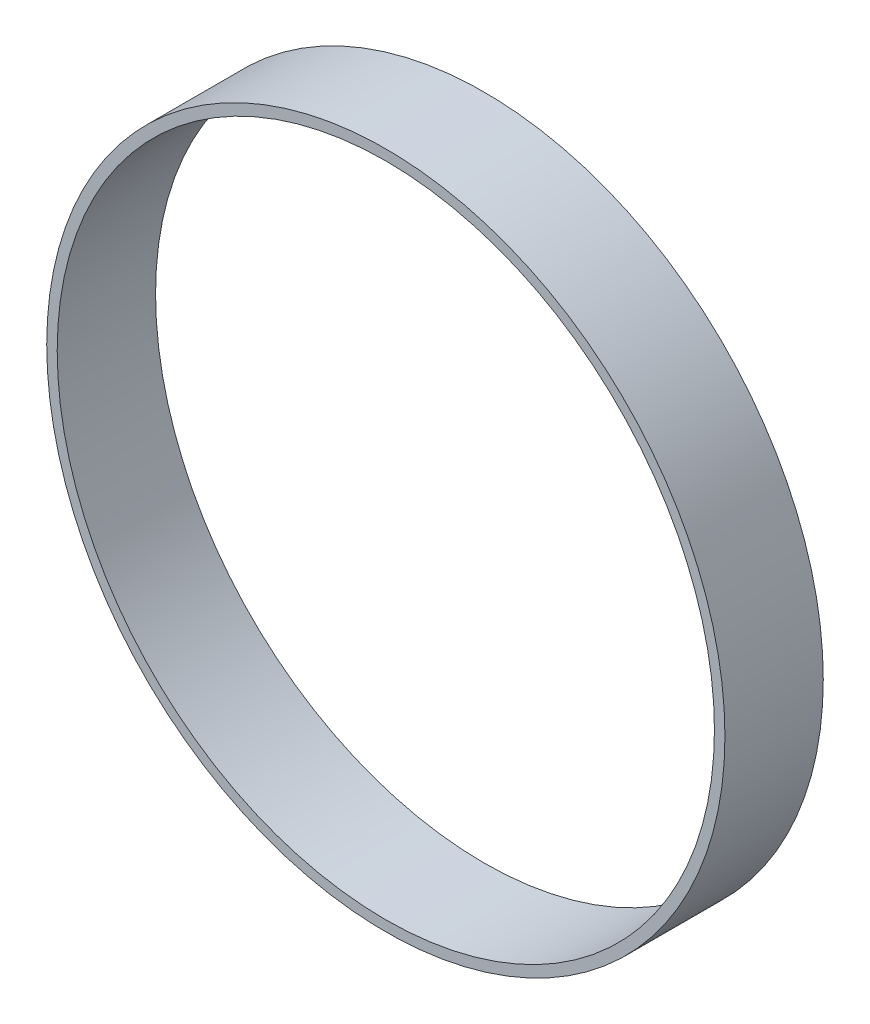
ISO-10303-21;
HEADER;
FILE_DESCRIPTION(('STEP AP214'),'2;1');
FILE_NAME('part.step','',(''),(''),'','','');
FILE_SCHEMA(('AUTOMOTIVE_DESIGN { 1 0 10303 214 1 1 1 1 }'));
ENDSEC;
DATA;
#1=APPLICATION_CONTEXT('core data for automotive mechanical design processes');
#2=APPLICATION_PROTOCOL_DEFINITION('international standard','automotive_design',2000,#1);
#3=PRODUCT_CONTEXT('',#1,'mechanical');
#4=PRODUCT('Part','Part','',(#3));
#5=PRODUCT_RELATED_PRODUCT_CATEGORY('part','',(#4));
#6=PRODUCT_DEFINITION_FORMATION('','',#4);
#7=PRODUCT_DEFINITION_CONTEXT('part definition',#1,'design');
#8=PRODUCT_DEFINITION('design','',#6,#7);
#9=PRODUCT_DEFINITION_SHAPE('','',#8);
#10=(LENGTH_UNIT() NAMED_UNIT(*) SI_UNIT(.MILLI.,.METRE.));
#11=(NAMED_UNIT(*) PLANE_ANGLE_UNIT() SI_UNIT($,.RADIAN.));
#12=(NAMED_UNIT(*) SI_UNIT($,.STERADIAN.) SOLID_ANGLE_UNIT());
#13=UNCERTAINTY_MEASURE_WITH_UNIT(LENGTH_MEASURE(1.E-05),#10,'distance_accuracy_value','');
#14=(GEOMETRIC_REPRESENTATION_CONTEXT(3) GLOBAL_UNCERTAINTY_ASSIGNED_CONTEXT((#13)) GLOBAL_UNIT_ASSIGNED_CONTEXT((#10,
#11,#12)) REPRESENTATION_CONTEXT('',''));
#15=CARTESIAN_POINT('',(0.,0.,0.));
#16=DIRECTION('',(0.,0.,1.));
#17=DIRECTION('',(1.,0.,0.));
#18=AXIS2_PLACEMENT_3D('',#15,#16,#17);
#19=CARTESIAN_POINT('',(0.,0.,4.7625));
#20=DIRECTION('',(0.,0.,1.));
#21=DIRECTION('',(1.,0.,0.));
#22=AXIS2_PLACEMENT_3D('',#19,#20,#21);
#23=PLANE('',#22);
#24=CARTESIAN_POINT('',(0.,0.,4.7625));
#25=DIRECTION('',(0.,0.,1.));
#26=DIRECTION('',(1.,0.,0.));
#27=AXIS2_PLACEMENT_3D('',#24,#25,#26);
#28=CIRCLE('',#27,16.4211);
#29=CARTESIAN_POINT('',(16.4211,0.,4.7625));
#30=VERTEX_POINT('',#29);
#31=EDGE_CURVE('E10',#30,#30,#28,.T.);
#32=ORIENTED_EDGE('',*,*,#31,.T.);
#33=EDGE_LOOP('',(#32));
#34=FACE_BOUND('',#33,.T.);
#35=CARTESIAN_POINT('',(0.,0.,4.7625));
#36=DIRECTION('',(0.,0.,1.));
#37=DIRECTION('',(1.,0.,0.));
#38=AXIS2_PLACEMENT_3D('',#35,#36,#37);
#39=CIRCLE('',#38,15.9131);
#40=CARTESIAN_POINT('',(15.9131,0.,4.7625));
#41=VERTEX_POINT('',#40);
#42=EDGE_CURVE('E47',#41,#41,#39,.T.);
#43=ORIENTED_EDGE('',*,*,#42,.F.);
#44=EDGE_LOOP('',(#43));
#45=FACE_BOUND('',#44,.T.);
#46=ADVANCED_FACE('F32',(#34,#45),#23,.T.);
#47=CARTESIAN_POINT('',(0.,0.,0.));
#48=DIRECTION('',(0.,0.,1.));
#49=DIRECTION('',(1.,0.,0.));
#50=AXIS2_PLACEMENT_3D('',#47,#48,#49);
#51=PLANE('',#50);
#52=CARTESIAN_POINT('',(0.,0.,0.));
#53=DIRECTION('',(0.,0.,1.));
#54=DIRECTION('',(1.,0.,0.));
#55=AXIS2_PLACEMENT_3D('',#52,#53,#54);
#56=CIRCLE('',#55,16.4211);
#57=CARTESIAN_POINT('',(16.4211,0.,0.));
#58=VERTEX_POINT('',#57);
#59=EDGE_CURVE('E36',#58,#58,#56,.T.);
#60=ORIENTED_EDGE('',*,*,#59,.F.);
#61=EDGE_LOOP('',(#60));
#62=FACE_BOUND('',#61,.T.);
#63=CARTESIAN_POINT('',(0.,0.,0.));
#64=DIRECTION('',(0.,0.,1.));
#65=DIRECTION('',(1.,0.,0.));
#66=AXIS2_PLACEMENT_3D('',#63,#64,#65);
#67=CIRCLE('',#66,15.9131);
#68=CARTESIAN_POINT('',(15.9131,0.,0.));
#69=VERTEX_POINT('',#68);
#70=EDGE_CURVE('E49',#69,#69,#67,.T.);
#71=ORIENTED_EDGE('',*,*,#70,.T.);
#72=EDGE_LOOP('',(#71));
#73=FACE_BOUND('',#72,.T.);
#74=ADVANCED_FACE('F59',(#62,#73),#51,.F.);
#75=CARTESIAN_POINT('',(0.,0.,4.7625));
#76=DIRECTION('',(0.,0.,-1.));
#77=DIRECTION('',(-1.,0.,0.));
#78=AXIS2_PLACEMENT_3D('',#75,#76,#77);
#79=CYLINDRICAL_SURFACE('',#78,16.4211);
#80=ORIENTED_EDGE('',*,*,#31,.F.);
#81=EDGE_LOOP('',(#80));
#82=FACE_BOUND('',#81,.T.);
#83=ORIENTED_EDGE('',*,*,#59,.T.);
#84=EDGE_LOOP('',(#83));
#85=FACE_BOUND('',#84,.T.);
#86=ADVANCED_FACE('F34',(#82,#85),#79,.T.);
#87=CARTESIAN_POINT('',(0.,0.,4.7625));
#88=DIRECTION('',(0.,0.,-1.));
#89=DIRECTION('',(-1.,0.,0.));
#90=AXIS2_PLACEMENT_3D('',#87,#88,#89);
#91=CYLINDRICAL_SURFACE('',#90,15.9131);
#92=ORIENTED_EDGE('',*,*,#42,.T.);
#93=EDGE_LOOP('',(#92));
#94=FACE_BOUND('',#93,.T.);
#95=ORIENTED_EDGE('',*,*,#70,.F.);
#96=EDGE_LOOP('',(#95));
#97=FACE_BOUND('',#96,.T.);
#98=ADVANCED_FACE('F55',(#94,#97),#91,.F.);
#99=CLOSED_SHELL('',(#46,#74,#86,#98));
#100=MANIFOLD_SOLID_BREP('B2',#99);
#101=ADVANCED_BREP_SHAPE_REPRESENTATION('',(#18,#100),#14);
#102=SHAPE_DEFINITION_REPRESENTATION(#9,#101);
ENDSEC;
END-ISO-10303-21;
